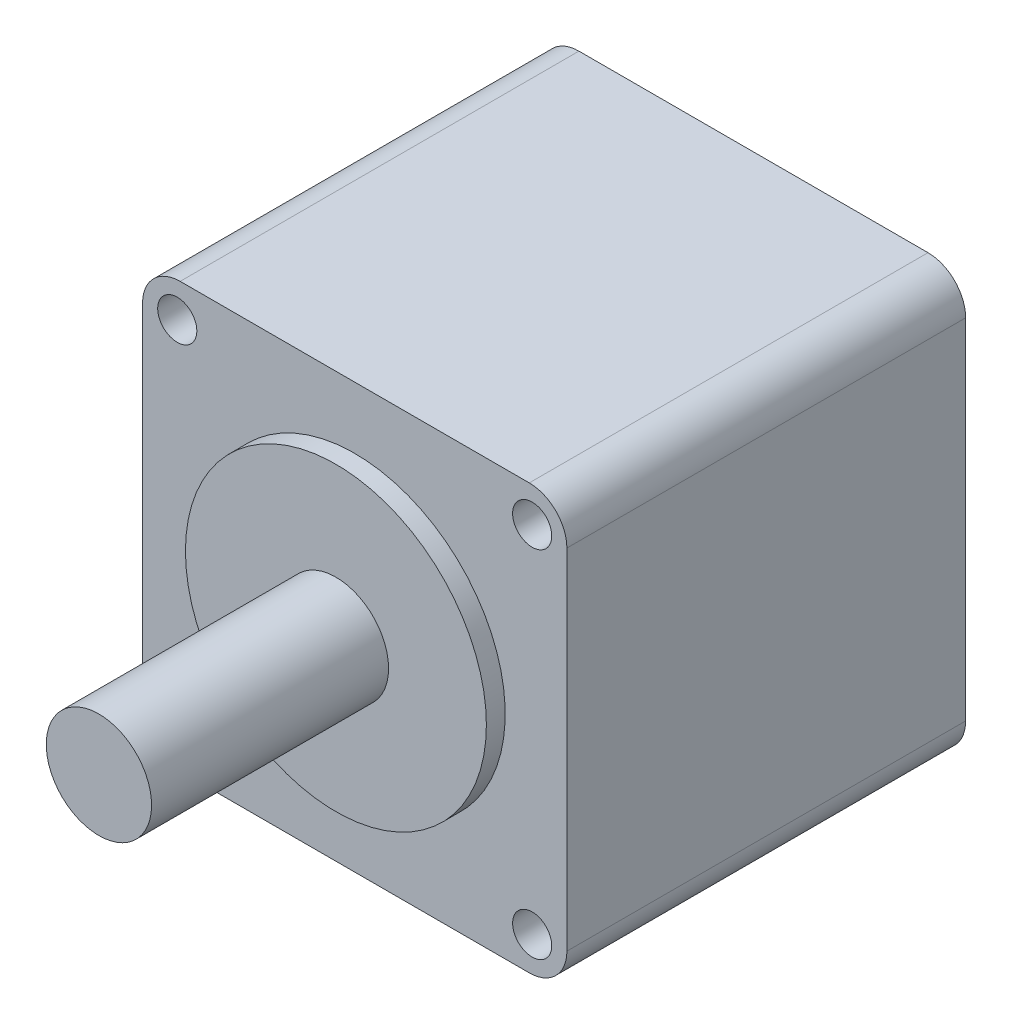
ISO-10303-21;
HEADER;
FILE_DESCRIPTION(('STEP AP214'),'2;1');
FILE_NAME('part.step','',(''),(''),'','','');
FILE_SCHEMA(('AUTOMOTIVE_DESIGN { 1 0 10303 214 1 1 1 1 }'));
ENDSEC;
DATA;
#1=APPLICATION_CONTEXT('core data for automotive mechanical design processes');
#2=APPLICATION_PROTOCOL_DEFINITION('international standard','automotive_design',2000,#1);
#3=PRODUCT_CONTEXT('',#1,'mechanical');
#4=PRODUCT('Part','Part','',(#3));
#5=PRODUCT_RELATED_PRODUCT_CATEGORY('part','',(#4));
#6=PRODUCT_DEFINITION_FORMATION('','',#4);
#7=PRODUCT_DEFINITION_CONTEXT('part definition',#1,'design');
#8=PRODUCT_DEFINITION('design','',#6,#7);
#9=PRODUCT_DEFINITION_SHAPE('','',#8);
#10=(LENGTH_UNIT() NAMED_UNIT(*) SI_UNIT(.MILLI.,.METRE.));
#11=(NAMED_UNIT(*) PLANE_ANGLE_UNIT() SI_UNIT($,.RADIAN.));
#12=(NAMED_UNIT(*) SI_UNIT($,.STERADIAN.) SOLID_ANGLE_UNIT());
#13=UNCERTAINTY_MEASURE_WITH_UNIT(LENGTH_MEASURE(1.E-05),#10,'distance_accuracy_value','');
#14=(GEOMETRIC_REPRESENTATION_CONTEXT(3) GLOBAL_UNCERTAINTY_ASSIGNED_CONTEXT((#13)) GLOBAL_UNIT_ASSIGNED_CONTEXT((#10,
#11,#12)) REPRESENTATION_CONTEXT('',''));
#15=CARTESIAN_POINT('',(0.,0.,0.));
#16=DIRECTION('',(0.,0.,1.));
#17=DIRECTION('',(1.,0.,0.));
#18=AXIS2_PLACEMENT_3D('',#15,#16,#17);
#19=CARTESIAN_POINT('',(0.,0.,53.));
#20=DIRECTION('',(1.,0.,0.));
#21=DIRECTION('',(0.,1.,0.));
#22=AXIS2_PLACEMENT_3D('',#19,#20,#21);
#23=PLANE('',#22);
#24=DIRECTION('',(0.,-1.,0.));
#25=VECTOR('',#24,1.);
#26=CARTESIAN_POINT('',(0.,0.,0.));
#27=LINE('',#26,#25);
#28=CARTESIAN_POINT('',(0.,51.4,0.));
#29=VERTEX_POINT('',#28);
#30=CARTESIAN_POINT('',(0.,5.,0.));
#31=VERTEX_POINT('',#30);
#32=EDGE_CURVE('E130',#29,#31,#27,.T.);
#33=ORIENTED_EDGE('',*,*,#32,.T.);
#34=DIRECTION('',(0.,0.,-1.));
#35=VECTOR('',#34,1.);
#36=CARTESIAN_POINT('',(0.,5.,53.));
#37=LINE('',#36,#35);
#38=CARTESIAN_POINT('',(0.,5.,53.));
#39=VERTEX_POINT('',#38);
#40=EDGE_CURVE('E107',#31,#39,#37,.F.);
#41=ORIENTED_EDGE('',*,*,#40,.T.);
#42=DIRECTION('',(0.,-1.,0.));
#43=VECTOR('',#42,1.);
#44=CARTESIAN_POINT('',(0.,0.,53.));
#45=LINE('',#44,#43);
#46=CARTESIAN_POINT('',(0.,51.4,53.));
#47=VERTEX_POINT('',#46);
#48=EDGE_CURVE('E140',#47,#39,#45,.T.);
#49=ORIENTED_EDGE('',*,*,#48,.F.);
#50=DIRECTION('',(0.,0.,-1.));
#51=VECTOR('',#50,1.);
#52=CARTESIAN_POINT('',(0.,51.4,53.));
#53=LINE('',#52,#51);
#54=EDGE_CURVE('E112',#47,#29,#53,.T.);
#55=ORIENTED_EDGE('',*,*,#54,.T.);
#56=EDGE_LOOP('',(#33,#41,#49,#55));
#57=FACE_BOUND('',#56,.T.);
#58=ADVANCED_FACE('F35',(#57),#23,.F.);
#59=CARTESIAN_POINT('',(0.,0.,53.));
#60=DIRECTION('',(0.,1.,0.));
#61=DIRECTION('',(0.,0.,1.));
#62=AXIS2_PLACEMENT_3D('',#59,#60,#61);
#63=PLANE('',#62);
#64=DIRECTION('',(1.,0.,0.));
#65=VECTOR('',#64,1.);
#66=CARTESIAN_POINT('',(0.,0.,53.));
#67=LINE('',#66,#65);
#68=CARTESIAN_POINT('',(5.,0.,53.));
#69=VERTEX_POINT('',#68);
#70=CARTESIAN_POINT('',(51.4,0.,53.));
#71=VERTEX_POINT('',#70);
#72=EDGE_CURVE('E122',#69,#71,#67,.T.);
#73=ORIENTED_EDGE('',*,*,#72,.F.);
#74=DIRECTION('',(0.,0.,-1.));
#75=VECTOR('',#74,1.);
#76=CARTESIAN_POINT('',(5.,0.,53.));
#77=LINE('',#76,#75);
#78=CARTESIAN_POINT('',(5.,0.,0.));
#79=VERTEX_POINT('',#78);
#80=EDGE_CURVE('E106',#69,#79,#77,.T.);
#81=ORIENTED_EDGE('',*,*,#80,.T.);
#82=DIRECTION('',(1.,0.,0.));
#83=VECTOR('',#82,1.);
#84=CARTESIAN_POINT('',(0.,0.,0.));
#85=LINE('',#84,#83);
#86=CARTESIAN_POINT('',(51.4,0.,0.));
#87=VERTEX_POINT('',#86);
#88=EDGE_CURVE('E119',#79,#87,#85,.T.);
#89=ORIENTED_EDGE('',*,*,#88,.T.);
#90=DIRECTION('',(0.,0.,-1.));
#91=VECTOR('',#90,1.);
#92=CARTESIAN_POINT('',(51.4,0.,53.));
#93=LINE('',#92,#91);
#94=EDGE_CURVE('E124',#87,#71,#93,.F.);
#95=ORIENTED_EDGE('',*,*,#94,.T.);
#96=EDGE_LOOP('',(#73,#81,#89,#95));
#97=FACE_BOUND('',#96,.T.);
#98=ADVANCED_FACE('F118',(#97),#63,.F.);
#99=CARTESIAN_POINT('',(56.4,0.,53.));
#100=DIRECTION('',(-1.,0.,0.));
#101=DIRECTION('',(0.,-1.,0.));
#102=AXIS2_PLACEMENT_3D('',#99,#100,#101);
#103=PLANE('',#102);
#104=DIRECTION('',(0.,1.,0.));
#105=VECTOR('',#104,1.);
#106=CARTESIAN_POINT('',(56.4,0.,53.));
#107=LINE('',#106,#105);
#108=CARTESIAN_POINT('',(56.4,5.,53.));
#109=VERTEX_POINT('',#108);
#110=CARTESIAN_POINT('',(56.4,51.4,53.));
#111=VERTEX_POINT('',#110);
#112=EDGE_CURVE('E166',#109,#111,#107,.T.);
#113=ORIENTED_EDGE('',*,*,#112,.F.);
#114=DIRECTION('',(0.,0.,-1.));
#115=VECTOR('',#114,1.);
#116=CARTESIAN_POINT('',(56.4,5.,53.));
#117=LINE('',#116,#115);
#118=CARTESIAN_POINT('',(56.4,5.,0.));
#119=VERTEX_POINT('',#118);
#120=EDGE_CURVE('E11',#109,#119,#117,.T.);
#121=ORIENTED_EDGE('',*,*,#120,.T.);
#122=DIRECTION('',(0.,1.,0.));
#123=VECTOR('',#122,1.);
#124=CARTESIAN_POINT('',(56.4,0.,0.));
#125=LINE('',#124,#123);
#126=CARTESIAN_POINT('',(56.4,51.4,0.));
#127=VERTEX_POINT('',#126);
#128=EDGE_CURVE('E129',#119,#127,#125,.T.);
#129=ORIENTED_EDGE('',*,*,#128,.T.);
#130=DIRECTION('',(0.,0.,-1.));
#131=VECTOR('',#130,1.);
#132=CARTESIAN_POINT('',(56.4,51.4,53.));
#133=LINE('',#132,#131);
#134=EDGE_CURVE('E43',#127,#111,#133,.F.);
#135=ORIENTED_EDGE('',*,*,#134,.T.);
#136=EDGE_LOOP('',(#113,#121,#129,#135));
#137=FACE_BOUND('',#136,.T.);
#138=ADVANCED_FACE('F165',(#137),#103,.F.);
#139=CARTESIAN_POINT('',(0.,56.4,53.));
#140=DIRECTION('',(0.,-1.,0.));
#141=DIRECTION('',(0.,0.,-1.));
#142=AXIS2_PLACEMENT_3D('',#139,#140,#141);
#143=PLANE('',#142);
#144=DIRECTION('',(-1.,0.,0.));
#145=VECTOR('',#144,1.);
#146=CARTESIAN_POINT('',(0.,56.4,0.));
#147=LINE('',#146,#145);
#148=CARTESIAN_POINT('',(51.4,56.4,0.));
#149=VERTEX_POINT('',#148);
#150=CARTESIAN_POINT('',(4.99999999999999,56.4,0.));
#151=VERTEX_POINT('',#150);
#152=EDGE_CURVE('E133',#149,#151,#147,.T.);
#153=ORIENTED_EDGE('',*,*,#152,.T.);
#154=DIRECTION('',(0.,0.,-1.));
#155=VECTOR('',#154,1.);
#156=CARTESIAN_POINT('',(4.99999999999999,56.4,53.));
#157=LINE('',#156,#155);
#158=CARTESIAN_POINT('',(4.99999999999999,56.4,53.));
#159=VERTEX_POINT('',#158);
#160=EDGE_CURVE('E50',#151,#159,#157,.F.);
#161=ORIENTED_EDGE('',*,*,#160,.T.);
#162=DIRECTION('',(-1.,0.,0.));
#163=VECTOR('',#162,1.);
#164=CARTESIAN_POINT('',(0.,56.4,53.));
#165=LINE('',#164,#163);
#166=CARTESIAN_POINT('',(51.4,56.4,53.));
#167=VERTEX_POINT('',#166);
#168=EDGE_CURVE('E144',#167,#159,#165,.T.);
#169=ORIENTED_EDGE('',*,*,#168,.F.);
#170=DIRECTION('',(0.,0.,-1.));
#171=VECTOR('',#170,1.);
#172=CARTESIAN_POINT('',(51.4,56.4,53.));
#173=LINE('',#172,#171);
#174=EDGE_CURVE('E159',#167,#149,#173,.T.);
#175=ORIENTED_EDGE('',*,*,#174,.T.);
#176=EDGE_LOOP('',(#153,#161,#169,#175));
#177=FACE_BOUND('',#176,.T.);
#178=ADVANCED_FACE('F175',(#177),#143,.F.);
#179=CARTESIAN_POINT('',(0.,0.,53.));
#180=DIRECTION('',(0.,0.,-1.));
#181=DIRECTION('',(-1.,0.,0.));
#182=AXIS2_PLACEMENT_3D('',#179,#180,#181);
#183=PLANE('',#182);
#184=CARTESIAN_POINT('',(51.785,51.785,53.));
#185=DIRECTION('',(0.,0.,1.));
#186=DIRECTION('',(-1.,0.,0.));
#187=AXIS2_PLACEMENT_3D('',#184,#185,#186);
#188=CIRCLE('',#187,2.6);
#189=CARTESIAN_POINT('',(49.185,51.785,53.));
#190=VERTEX_POINT('',#189);
#191=EDGE_CURVE('E212',#190,#190,#188,.T.);
#192=ORIENTED_EDGE('',*,*,#191,.F.);
#193=EDGE_LOOP('',(#192));
#194=FACE_BOUND('',#193,.T.);
#195=CARTESIAN_POINT('',(51.785,4.615,53.));
#196=DIRECTION('',(0.,0.,1.));
#197=DIRECTION('',(1.,0.,0.));
#198=AXIS2_PLACEMENT_3D('',#195,#196,#197);
#199=CIRCLE('',#198,2.6);
#200=CARTESIAN_POINT('',(54.385,4.615,53.));
#201=VERTEX_POINT('',#200);
#202=EDGE_CURVE('E206',#201,#201,#199,.T.);
#203=ORIENTED_EDGE('',*,*,#202,.F.);
#204=EDGE_LOOP('',(#203));
#205=FACE_BOUND('',#204,.T.);
#206=CARTESIAN_POINT('',(4.61499999999999,4.615,53.));
#207=DIRECTION('',(0.,0.,1.));
#208=DIRECTION('',(-1.,0.,0.));
#209=AXIS2_PLACEMENT_3D('',#206,#207,#208);
#210=CIRCLE('',#209,2.6);
#211=CARTESIAN_POINT('',(2.01499999999999,4.615,53.));
#212=VERTEX_POINT('',#211);
#213=EDGE_CURVE('E200',#212,#212,#210,.T.);
#214=ORIENTED_EDGE('',*,*,#213,.F.);
#215=EDGE_LOOP('',(#214));
#216=FACE_BOUND('',#215,.T.);
#217=CARTESIAN_POINT('',(4.61499999999998,51.785,53.));
#218=DIRECTION('',(0.,0.,1.));
#219=DIRECTION('',(1.,0.,0.));
#220=AXIS2_PLACEMENT_3D('',#217,#218,#219);
#221=CIRCLE('',#220,2.6);
#222=CARTESIAN_POINT('',(7.21499999999998,51.785,53.));
#223=VERTEX_POINT('',#222);
#224=EDGE_CURVE('E194',#223,#223,#221,.T.);
#225=ORIENTED_EDGE('',*,*,#224,.F.);
#226=EDGE_LOOP('',(#225));
#227=FACE_BOUND('',#226,.T.);
#228=CARTESIAN_POINT('',(28.2,28.2,53.));
#229=DIRECTION('',(0.,0.,-1.));
#230=DIRECTION('',(-1.,0.,0.));
#231=AXIS2_PLACEMENT_3D('',#228,#229,#230);
#232=CIRCLE('',#231,20.);
#233=CARTESIAN_POINT('',(8.19999999999999,28.2,53.));
#234=VERTEX_POINT('',#233);
#235=EDGE_CURVE('E141',#234,#234,#232,.F.);
#236=ORIENTED_EDGE('',*,*,#235,.F.);
#237=EDGE_LOOP('',(#236));
#238=FACE_BOUND('',#237,.T.);
#239=ORIENTED_EDGE('',*,*,#48,.T.);
#240=CARTESIAN_POINT('',(5.,5.,53.));
#241=DIRECTION('',(0.,0.,-1.));
#242=DIRECTION('',(-1.,0.,0.));
#243=AXIS2_PLACEMENT_3D('',#240,#241,#242);
#244=CIRCLE('',#243,5.);
#245=EDGE_CURVE('E157',#39,#69,#244,.F.);
#246=ORIENTED_EDGE('',*,*,#245,.T.);
#247=ORIENTED_EDGE('',*,*,#72,.T.);
#248=CARTESIAN_POINT('',(51.4,5.,53.));
#249=DIRECTION('',(0.,0.,-1.));
#250=DIRECTION('',(-1.,0.,0.));
#251=AXIS2_PLACEMENT_3D('',#248,#249,#250);
#252=CIRCLE('',#251,5.);
#253=EDGE_CURVE('E153',#71,#109,#252,.F.);
#254=ORIENTED_EDGE('',*,*,#253,.T.);
#255=ORIENTED_EDGE('',*,*,#112,.T.);
#256=CARTESIAN_POINT('',(51.4,51.4,53.));
#257=DIRECTION('',(0.,0.,-1.));
#258=DIRECTION('',(-1.,0.,0.));
#259=AXIS2_PLACEMENT_3D('',#256,#257,#258);
#260=CIRCLE('',#259,5.);
#261=EDGE_CURVE('E57',#111,#167,#260,.F.);
#262=ORIENTED_EDGE('',*,*,#261,.T.);
#263=ORIENTED_EDGE('',*,*,#168,.T.);
#264=CARTESIAN_POINT('',(4.99999999999999,51.4,53.));
#265=DIRECTION('',(0.,0.,-1.));
#266=DIRECTION('',(-1.,0.,0.));
#267=AXIS2_PLACEMENT_3D('',#264,#265,#266);
#268=CIRCLE('',#267,5.);
#269=EDGE_CURVE('E155',#159,#47,#268,.F.);
#270=ORIENTED_EDGE('',*,*,#269,.T.);
#271=EDGE_LOOP('',(#239,#246,#247,#254,#255,#262,#263,#270));
#272=FACE_BOUND('',#271,.T.);
#273=ADVANCED_FACE('F170',(#194,#205,#216,#227,#238,#272),#183,.F.);
#274=CARTESIAN_POINT('',(0.,0.,0.));
#275=DIRECTION('',(0.,0.,-1.));
#276=DIRECTION('',(-1.,0.,0.));
#277=AXIS2_PLACEMENT_3D('',#274,#275,#276);
#278=PLANE('',#277);
#279=CARTESIAN_POINT('',(51.785,51.785,0.));
#280=DIRECTION('',(0.,0.,1.));
#281=DIRECTION('',(-1.,0.,0.));
#282=AXIS2_PLACEMENT_3D('',#279,#280,#281);
#283=CIRCLE('',#282,2.6);
#284=CARTESIAN_POINT('',(49.185,51.785,0.));
#285=VERTEX_POINT('',#284);
#286=EDGE_CURVE('E197',#285,#285,#283,.T.);
#287=ORIENTED_EDGE('',*,*,#286,.T.);
#288=EDGE_LOOP('',(#287));
#289=FACE_BOUND('',#288,.T.);
#290=CARTESIAN_POINT('',(51.785,4.615,0.));
#291=DIRECTION('',(0.,0.,1.));
#292=DIRECTION('',(1.,0.,0.));
#293=AXIS2_PLACEMENT_3D('',#290,#291,#292);
#294=CIRCLE('',#293,2.6);
#295=CARTESIAN_POINT('',(54.385,4.615,0.));
#296=VERTEX_POINT('',#295);
#297=EDGE_CURVE('E209',#296,#296,#294,.T.);
#298=ORIENTED_EDGE('',*,*,#297,.T.);
#299=EDGE_LOOP('',(#298));
#300=FACE_BOUND('',#299,.T.);
#301=CARTESIAN_POINT('',(4.61499999999999,4.615,0.));
#302=DIRECTION('',(0.,0.,1.));
#303=DIRECTION('',(-1.,0.,0.));
#304=AXIS2_PLACEMENT_3D('',#301,#302,#303);
#305=CIRCLE('',#304,2.6);
#306=CARTESIAN_POINT('',(2.01499999999999,4.615,0.));
#307=VERTEX_POINT('',#306);
#308=EDGE_CURVE('E203',#307,#307,#305,.T.);
#309=ORIENTED_EDGE('',*,*,#308,.T.);
#310=EDGE_LOOP('',(#309));
#311=FACE_BOUND('',#310,.T.);
#312=CARTESIAN_POINT('',(4.61499999999998,51.785,0.));
#313=DIRECTION('',(0.,0.,1.));
#314=DIRECTION('',(1.,0.,0.));
#315=AXIS2_PLACEMENT_3D('',#312,#313,#314);
#316=CIRCLE('',#315,2.6);
#317=CARTESIAN_POINT('',(7.21499999999998,51.785,0.));
#318=VERTEX_POINT('',#317);
#319=EDGE_CURVE('E191',#318,#318,#316,.T.);
#320=ORIENTED_EDGE('',*,*,#319,.T.);
#321=EDGE_LOOP('',(#320));
#322=FACE_BOUND('',#321,.T.);
#323=ORIENTED_EDGE('',*,*,#88,.F.);
#324=CARTESIAN_POINT('',(5.,5.,0.));
#325=DIRECTION('',(0.,0.,-1.));
#326=DIRECTION('',(-1.,0.,0.));
#327=AXIS2_PLACEMENT_3D('',#324,#325,#326);
#328=CIRCLE('',#327,5.);
#329=EDGE_CURVE('E102',#79,#31,#328,.T.);
#330=ORIENTED_EDGE('',*,*,#329,.T.);
#331=ORIENTED_EDGE('',*,*,#32,.F.);
#332=CARTESIAN_POINT('',(4.99999999999999,51.4,0.));
#333=DIRECTION('',(0.,0.,-1.));
#334=DIRECTION('',(-1.,0.,0.));
#335=AXIS2_PLACEMENT_3D('',#332,#333,#334);
#336=CIRCLE('',#335,5.);
#337=EDGE_CURVE('E113',#29,#151,#336,.T.);
#338=ORIENTED_EDGE('',*,*,#337,.T.);
#339=ORIENTED_EDGE('',*,*,#152,.F.);
#340=CARTESIAN_POINT('',(51.4,51.4,0.));
#341=DIRECTION('',(0.,0.,-1.));
#342=DIRECTION('',(-1.,0.,0.));
#343=AXIS2_PLACEMENT_3D('',#340,#341,#342);
#344=CIRCLE('',#343,5.);
#345=EDGE_CURVE('E123',#149,#127,#344,.T.);
#346=ORIENTED_EDGE('',*,*,#345,.T.);
#347=ORIENTED_EDGE('',*,*,#128,.F.);
#348=CARTESIAN_POINT('',(51.4,5.,0.));
#349=DIRECTION('',(0.,0.,-1.));
#350=DIRECTION('',(-1.,0.,0.));
#351=AXIS2_PLACEMENT_3D('',#348,#349,#350);
#352=CIRCLE('',#351,5.);
#353=EDGE_CURVE('E128',#119,#87,#352,.T.);
#354=ORIENTED_EDGE('',*,*,#353,.T.);
#355=EDGE_LOOP('',(#323,#330,#331,#338,#339,#346,#347,#354));
#356=FACE_BOUND('',#355,.T.);
#357=ADVANCED_FACE('F126',(#289,#300,#311,#322,#356),#278,.T.);
#358=CARTESIAN_POINT('',(28.2,28.2,55.5));
#359=DIRECTION('',(0.,0.,-1.));
#360=DIRECTION('',(-1.,0.,0.));
#361=AXIS2_PLACEMENT_3D('',#358,#359,#360);
#362=CYLINDRICAL_SURFACE('',#361,20.);
#363=CARTESIAN_POINT('',(28.2,28.2,55.5));
#364=DIRECTION('',(0.,0.,1.));
#365=DIRECTION('',(1.,0.,0.));
#366=AXIS2_PLACEMENT_3D('',#363,#364,#365);
#367=CIRCLE('',#366,20.);
#368=CARTESIAN_POINT('',(48.2,28.2,55.5));
#369=VERTEX_POINT('',#368);
#370=EDGE_CURVE('E135',#369,#369,#367,.T.);
#371=ORIENTED_EDGE('',*,*,#370,.F.);
#372=EDGE_LOOP('',(#371));
#373=FACE_BOUND('',#372,.T.);
#374=ORIENTED_EDGE('',*,*,#235,.T.);
#375=EDGE_LOOP('',(#374));
#376=FACE_BOUND('',#375,.T.);
#377=ADVANCED_FACE('F238',(#373,#376),#362,.T.);
#378=CARTESIAN_POINT('',(28.2,28.2,55.5));
#379=DIRECTION('',(0.,0.,1.));
#380=DIRECTION('',(1.,0.,0.));
#381=AXIS2_PLACEMENT_3D('',#378,#379,#380);
#382=PLANE('',#381);
#383=CARTESIAN_POINT('',(28.2,28.2,55.5));
#384=DIRECTION('',(0.,0.,1.));
#385=DIRECTION('',(1.,0.,0.));
#386=AXIS2_PLACEMENT_3D('',#383,#384,#385);
#387=CIRCLE('',#386,7.);
#388=CARTESIAN_POINT('',(35.2,28.2,55.5));
#389=VERTEX_POINT('',#388);
#390=EDGE_CURVE('E188',#389,#389,#387,.T.);
#391=ORIENTED_EDGE('',*,*,#390,.F.);
#392=EDGE_LOOP('',(#391));
#393=FACE_BOUND('',#392,.T.);
#394=ORIENTED_EDGE('',*,*,#370,.T.);
#395=EDGE_LOOP('',(#394));
#396=FACE_BOUND('',#395,.T.);
#397=ADVANCED_FACE('F240',(#393,#396),#382,.T.);
#398=CARTESIAN_POINT('',(28.2,28.2,87.));
#399=DIRECTION('',(0.,0.,-1.));
#400=DIRECTION('',(-1.,0.,0.));
#401=AXIS2_PLACEMENT_3D('',#398,#399,#400);
#402=CYLINDRICAL_SURFACE('',#401,7.);
#403=CARTESIAN_POINT('',(28.2,28.2,87.));
#404=DIRECTION('',(0.,0.,1.));
#405=DIRECTION('',(1.,0.,0.));
#406=AXIS2_PLACEMENT_3D('',#403,#404,#405);
#407=CIRCLE('',#406,7.);
#408=CARTESIAN_POINT('',(35.2,28.2,87.));
#409=VERTEX_POINT('',#408);
#410=EDGE_CURVE('E187',#409,#409,#407,.T.);
#411=ORIENTED_EDGE('',*,*,#410,.F.);
#412=EDGE_LOOP('',(#411));
#413=FACE_BOUND('',#412,.T.);
#414=ORIENTED_EDGE('',*,*,#390,.T.);
#415=EDGE_LOOP('',(#414));
#416=FACE_BOUND('',#415,.T.);
#417=ADVANCED_FACE('F247',(#413,#416),#402,.T.);
#418=CARTESIAN_POINT('',(28.2,28.2,87.));
#419=DIRECTION('',(0.,0.,1.));
#420=DIRECTION('',(1.,0.,0.));
#421=AXIS2_PLACEMENT_3D('',#418,#419,#420);
#422=PLANE('',#421);
#423=ORIENTED_EDGE('',*,*,#410,.T.);
#424=EDGE_LOOP('',(#423));
#425=FACE_BOUND('',#424,.T.);
#426=ADVANCED_FACE('F264',(#425),#422,.T.);
#427=CARTESIAN_POINT('',(5.,5.,53.));
#428=DIRECTION('',(0.,0.,-1.));
#429=DIRECTION('',(-1.,0.,0.));
#430=AXIS2_PLACEMENT_3D('',#427,#428,#429);
#431=CYLINDRICAL_SURFACE('',#430,5.);
#432=ORIENTED_EDGE('',*,*,#245,.F.);
#433=ORIENTED_EDGE('',*,*,#40,.F.);
#434=ORIENTED_EDGE('',*,*,#329,.F.);
#435=ORIENTED_EDGE('',*,*,#80,.F.);
#436=EDGE_LOOP('',(#432,#433,#434,#435));
#437=FACE_BOUND('',#436,.T.);
#438=ADVANCED_FACE('F105',(#437),#431,.T.);
#439=CARTESIAN_POINT('',(4.99999999999999,51.4,53.));
#440=DIRECTION('',(0.,0.,-1.));
#441=DIRECTION('',(-1.,0.,0.));
#442=AXIS2_PLACEMENT_3D('',#439,#440,#441);
#443=CYLINDRICAL_SURFACE('',#442,5.);
#444=ORIENTED_EDGE('',*,*,#269,.F.);
#445=ORIENTED_EDGE('',*,*,#160,.F.);
#446=ORIENTED_EDGE('',*,*,#337,.F.);
#447=ORIENTED_EDGE('',*,*,#54,.F.);
#448=EDGE_LOOP('',(#444,#445,#446,#447));
#449=FACE_BOUND('',#448,.T.);
#450=ADVANCED_FACE('F179',(#449),#443,.T.);
#451=CARTESIAN_POINT('',(51.4,5.,53.));
#452=DIRECTION('',(0.,0.,-1.));
#453=DIRECTION('',(-1.,0.,0.));
#454=AXIS2_PLACEMENT_3D('',#451,#452,#453);
#455=CYLINDRICAL_SURFACE('',#454,5.);
#456=ORIENTED_EDGE('',*,*,#253,.F.);
#457=ORIENTED_EDGE('',*,*,#94,.F.);
#458=ORIENTED_EDGE('',*,*,#353,.F.);
#459=ORIENTED_EDGE('',*,*,#120,.F.);
#460=EDGE_LOOP('',(#456,#457,#458,#459));
#461=FACE_BOUND('',#460,.T.);
#462=ADVANCED_FACE('F266',(#461),#455,.T.);
#463=CARTESIAN_POINT('',(51.4,51.4,53.));
#464=DIRECTION('',(0.,0.,-1.));
#465=DIRECTION('',(-1.,0.,0.));
#466=AXIS2_PLACEMENT_3D('',#463,#464,#465);
#467=CYLINDRICAL_SURFACE('',#466,5.);
#468=ORIENTED_EDGE('',*,*,#261,.F.);
#469=ORIENTED_EDGE('',*,*,#134,.F.);
#470=ORIENTED_EDGE('',*,*,#345,.F.);
#471=ORIENTED_EDGE('',*,*,#174,.F.);
#472=EDGE_LOOP('',(#468,#469,#470,#471));
#473=FACE_BOUND('',#472,.T.);
#474=ADVANCED_FACE('F37',(#473),#467,.T.);
#475=CARTESIAN_POINT('',(4.61499999999998,51.785,0.));
#476=DIRECTION('',(0.,0.,1.));
#477=DIRECTION('',(1.,0.,0.));
#478=AXIS2_PLACEMENT_3D('',#475,#476,#477);
#479=CYLINDRICAL_SURFACE('',#478,2.6);
#480=ORIENTED_EDGE('',*,*,#319,.F.);
#481=EDGE_LOOP('',(#480));
#482=FACE_BOUND('',#481,.T.);
#483=ORIENTED_EDGE('',*,*,#224,.T.);
#484=EDGE_LOOP('',(#483));
#485=FACE_BOUND('',#484,.T.);
#486=ADVANCED_FACE('F272',(#482,#485),#479,.F.);
#487=CARTESIAN_POINT('',(4.61499999999999,4.615,0.));
#488=DIRECTION('',(0.,0.,1.));
#489=DIRECTION('',(1.,0.,0.));
#490=AXIS2_PLACEMENT_3D('',#487,#488,#489);
#491=CYLINDRICAL_SURFACE('',#490,2.6);
#492=ORIENTED_EDGE('',*,*,#308,.F.);
#493=EDGE_LOOP('',(#492));
#494=FACE_BOUND('',#493,.T.);
#495=ORIENTED_EDGE('',*,*,#213,.T.);
#496=EDGE_LOOP('',(#495));
#497=FACE_BOUND('',#496,.T.);
#498=ADVANCED_FACE('F276',(#494,#497),#491,.F.);
#499=CARTESIAN_POINT('',(51.785,4.615,0.));
#500=DIRECTION('',(0.,0.,1.));
#501=DIRECTION('',(1.,0.,0.));
#502=AXIS2_PLACEMENT_3D('',#499,#500,#501);
#503=CYLINDRICAL_SURFACE('',#502,2.6);
#504=ORIENTED_EDGE('',*,*,#297,.F.);
#505=EDGE_LOOP('',(#504));
#506=FACE_BOUND('',#505,.T.);
#507=ORIENTED_EDGE('',*,*,#202,.T.);
#508=EDGE_LOOP('',(#507));
#509=FACE_BOUND('',#508,.T.);
#510=ADVANCED_FACE('F223',(#506,#509),#503,.F.);
#511=CARTESIAN_POINT('',(51.785,51.785,0.));
#512=DIRECTION('',(0.,0.,1.));
#513=DIRECTION('',(1.,0.,0.));
#514=AXIS2_PLACEMENT_3D('',#511,#512,#513);
#515=CYLINDRICAL_SURFACE('',#514,2.6);
#516=ORIENTED_EDGE('',*,*,#286,.F.);
#517=EDGE_LOOP('',(#516));
#518=FACE_BOUND('',#517,.T.);
#519=ORIENTED_EDGE('',*,*,#191,.T.);
#520=EDGE_LOOP('',(#519));
#521=FACE_BOUND('',#520,.T.);
#522=ADVANCED_FACE('F220',(#518,#521),#515,.F.);
#523=CLOSED_SHELL('',(#58,#98,#138,#178,#273,#357,#377,#397,#417,#426,#438,#450,#462,#474,#486,
#498,#510,#522));
#524=MANIFOLD_SOLID_BREP('B2',#523);
#525=ADVANCED_BREP_SHAPE_REPRESENTATION('',(#18,#524),#14);
#526=SHAPE_DEFINITION_REPRESENTATION(#9,#525);
ENDSEC;
END-ISO-10303-21;
